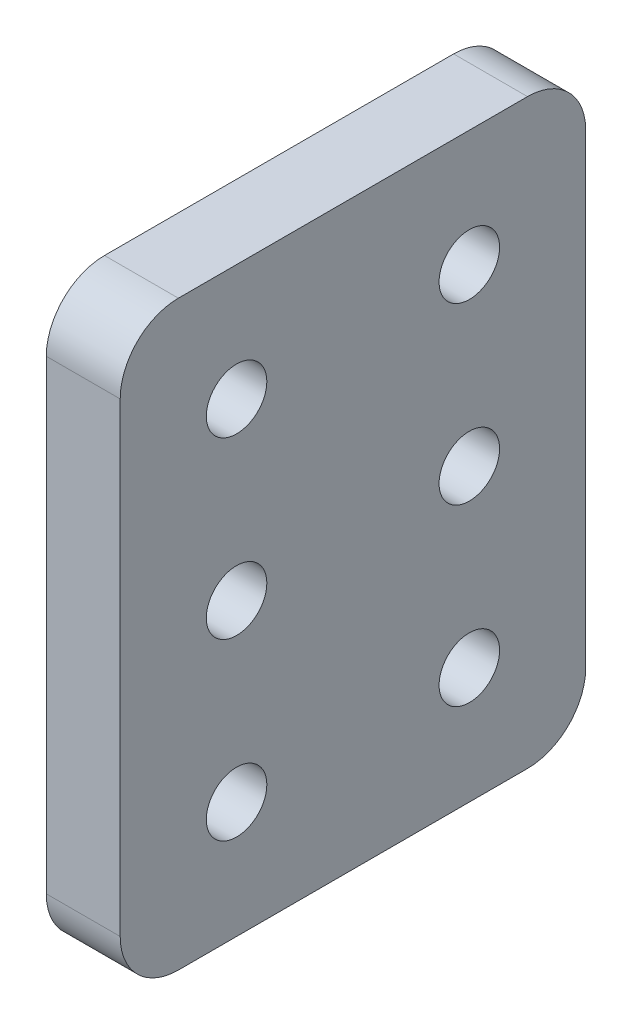
ISO-10303-21;
HEADER;
FILE_DESCRIPTION(('STEP AP214'),'2;1');
FILE_NAME('part.step','',(''),(''),'','','');
FILE_SCHEMA(('AUTOMOTIVE_DESIGN { 1 0 10303 214 1 1 1 1 }'));
ENDSEC;
DATA;
#1=APPLICATION_CONTEXT('core data for automotive mechanical design processes');
#2=APPLICATION_PROTOCOL_DEFINITION('international standard','automotive_design',2000,#1);
#3=PRODUCT_CONTEXT('',#1,'mechanical');
#4=PRODUCT('Part','Part','',(#3));
#5=PRODUCT_RELATED_PRODUCT_CATEGORY('part','',(#4));
#6=PRODUCT_DEFINITION_FORMATION('','',#4);
#7=PRODUCT_DEFINITION_CONTEXT('part definition',#1,'design');
#8=PRODUCT_DEFINITION('design','',#6,#7);
#9=PRODUCT_DEFINITION_SHAPE('','',#8);
#10=(LENGTH_UNIT() NAMED_UNIT(*) SI_UNIT(.MILLI.,.METRE.));
#11=(NAMED_UNIT(*) PLANE_ANGLE_UNIT() SI_UNIT($,.RADIAN.));
#12=(NAMED_UNIT(*) SI_UNIT($,.STERADIAN.) SOLID_ANGLE_UNIT());
#13=UNCERTAINTY_MEASURE_WITH_UNIT(LENGTH_MEASURE(1.E-05),#10,'distance_accuracy_value','');
#14=(GEOMETRIC_REPRESENTATION_CONTEXT(3) GLOBAL_UNCERTAINTY_ASSIGNED_CONTEXT((#13)) GLOBAL_UNIT_ASSIGNED_CONTEXT((#10,
#11,#12)) REPRESENTATION_CONTEXT('',''));
#15=CARTESIAN_POINT('',(0.,0.,0.));
#16=DIRECTION('',(0.,0.,1.));
#17=DIRECTION('',(1.,0.,0.));
#18=AXIS2_PLACEMENT_3D('',#15,#16,#17);
#19=CARTESIAN_POINT('',(43.5,73.,-125.6));
#20=DIRECTION('',(-1.,0.,0.));
#21=DIRECTION('',(0.,0.,1.));
#22=AXIS2_PLACEMENT_3D('',#19,#20,#21);
#23=PLANE('',#22);
#24=CARTESIAN_POINT('',(43.5,58.,-135.6));
#25=DIRECTION('',(-1.,0.,0.));
#26=DIRECTION('',(0.,0.,1.));
#27=AXIS2_PLACEMENT_3D('',#24,#25,#26);
#28=CIRCLE('',#27,2.6);
#29=CARTESIAN_POINT('',(43.5,58.,-138.2));
#30=VERTEX_POINT('',#29);
#31=EDGE_CURVE('E141',#30,#30,#28,.T.);
#32=ORIENTED_EDGE('',*,*,#31,.T.);
#33=EDGE_LOOP('',(#32));
#34=FACE_BOUND('',#33,.T.);
#35=CARTESIAN_POINT('',(43.5,73.,-135.6));
#36=DIRECTION('',(-1.,0.,0.));
#37=DIRECTION('',(0.,0.,1.));
#38=AXIS2_PLACEMENT_3D('',#35,#36,#37);
#39=CIRCLE('',#38,2.6);
#40=CARTESIAN_POINT('',(43.5,73.,-138.2));
#41=VERTEX_POINT('',#40);
#42=EDGE_CURVE('E167',#41,#41,#39,.T.);
#43=ORIENTED_EDGE('',*,*,#42,.T.);
#44=EDGE_LOOP('',(#43));
#45=FACE_BOUND('',#44,.T.);
#46=CARTESIAN_POINT('',(43.5,88.,-135.6));
#47=DIRECTION('',(-1.,0.,0.));
#48=DIRECTION('',(0.,0.,1.));
#49=AXIS2_PLACEMENT_3D('',#46,#47,#48);
#50=CIRCLE('',#49,2.6);
#51=CARTESIAN_POINT('',(43.5,88.,-138.2));
#52=VERTEX_POINT('',#51);
#53=EDGE_CURVE('E168',#52,#52,#50,.T.);
#54=ORIENTED_EDGE('',*,*,#53,.T.);
#55=EDGE_LOOP('',(#54));
#56=FACE_BOUND('',#55,.T.);
#57=CARTESIAN_POINT('',(43.5,58.,-115.6));
#58=DIRECTION('',(-1.,0.,0.));
#59=DIRECTION('',(0.,0.,1.));
#60=AXIS2_PLACEMENT_3D('',#57,#58,#59);
#61=CIRCLE('',#60,2.6);
#62=CARTESIAN_POINT('',(43.5,58.,-118.2));
#63=VERTEX_POINT('',#62);
#64=EDGE_CURVE('E238',#63,#63,#61,.T.);
#65=ORIENTED_EDGE('',*,*,#64,.T.);
#66=EDGE_LOOP('',(#65));
#67=FACE_BOUND('',#66,.T.);
#68=CARTESIAN_POINT('',(43.5,73.,-115.6));
#69=DIRECTION('',(-1.,0.,0.));
#70=DIRECTION('',(0.,0.,1.));
#71=AXIS2_PLACEMENT_3D('',#68,#69,#70);
#72=CIRCLE('',#71,2.6);
#73=CARTESIAN_POINT('',(43.5,73.,-118.2));
#74=VERTEX_POINT('',#73);
#75=EDGE_CURVE('E244',#74,#74,#72,.T.);
#76=ORIENTED_EDGE('',*,*,#75,.T.);
#77=EDGE_LOOP('',(#76));
#78=FACE_BOUND('',#77,.T.);
#79=CARTESIAN_POINT('',(43.5,88.,-115.6));
#80=DIRECTION('',(-1.,0.,0.));
#81=DIRECTION('',(0.,0.,1.));
#82=AXIS2_PLACEMENT_3D('',#79,#80,#81);
#83=CIRCLE('',#82,2.6);
#84=CARTESIAN_POINT('',(43.5,88.,-118.2));
#85=VERTEX_POINT('',#84);
#86=EDGE_CURVE('E181',#85,#85,#83,.T.);
#87=ORIENTED_EDGE('',*,*,#86,.T.);
#88=EDGE_LOOP('',(#87));
#89=FACE_BOUND('',#88,.T.);
#90=CARTESIAN_POINT('',(43.5,93.,-140.6));
#91=DIRECTION('',(-1.,0.,0.));
#92=DIRECTION('',(0.,0.707106781186548,-0.707106781186548));
#93=AXIS2_PLACEMENT_3D('',#90,#91,#92);
#94=CIRCLE('',#93,5.);
#95=CARTESIAN_POINT('',(43.5,98.,-140.6));
#96=VERTEX_POINT('',#95);
#97=CARTESIAN_POINT('',(43.5,93.,-145.6));
#98=VERTEX_POINT('',#97);
#99=EDGE_CURVE('E163',#96,#98,#94,.T.);
#100=ORIENTED_EDGE('',*,*,#99,.F.);
#101=DIRECTION('',(0.,0.,1.));
#102=VECTOR('',#101,1.);
#103=CARTESIAN_POINT('',(43.5,98.,-145.6));
#104=LINE('',#103,#102);
#105=CARTESIAN_POINT('',(43.5,98.,-110.6));
#106=VERTEX_POINT('',#105);
#107=EDGE_CURVE('E199',#96,#106,#104,.T.);
#108=ORIENTED_EDGE('',*,*,#107,.T.);
#109=CARTESIAN_POINT('',(43.5,93.,-110.6));
#110=DIRECTION('',(-1.,0.,0.));
#111=DIRECTION('',(0.,0.707106781186548,0.707106781186548));
#112=AXIS2_PLACEMENT_3D('',#109,#110,#111);
#113=CIRCLE('',#112,5.);
#114=CARTESIAN_POINT('',(43.5,93.,-105.6));
#115=VERTEX_POINT('',#114);
#116=EDGE_CURVE('E156',#115,#106,#113,.T.);
#117=ORIENTED_EDGE('',*,*,#116,.F.);
#118=DIRECTION('',(0.,-1.,0.));
#119=VECTOR('',#118,1.);
#120=CARTESIAN_POINT('',(43.5,98.,-105.6));
#121=LINE('',#120,#119);
#122=CARTESIAN_POINT('',(43.5,53.,-105.6));
#123=VERTEX_POINT('',#122);
#124=EDGE_CURVE('E194',#115,#123,#121,.T.);
#125=ORIENTED_EDGE('',*,*,#124,.T.);
#126=CARTESIAN_POINT('',(43.5,53.,-110.6));
#127=DIRECTION('',(-1.,0.,0.));
#128=DIRECTION('',(0.,-0.707106781186548,0.707106781186548));
#129=AXIS2_PLACEMENT_3D('',#126,#127,#128);
#130=CIRCLE('',#129,5.);
#131=CARTESIAN_POINT('',(43.5,48.,-110.6));
#132=VERTEX_POINT('',#131);
#133=EDGE_CURVE('E170',#132,#123,#130,.T.);
#134=ORIENTED_EDGE('',*,*,#133,.F.);
#135=DIRECTION('',(0.,0.,-1.));
#136=VECTOR('',#135,1.);
#137=CARTESIAN_POINT('',(43.5,48.,-105.6));
#138=LINE('',#137,#136);
#139=CARTESIAN_POINT('',(43.5,48.,-140.6));
#140=VERTEX_POINT('',#139);
#141=EDGE_CURVE('E177',#132,#140,#138,.T.);
#142=ORIENTED_EDGE('',*,*,#141,.T.);
#143=CARTESIAN_POINT('',(43.5,53.,-140.6));
#144=DIRECTION('',(-1.,0.,0.));
#145=DIRECTION('',(0.,-0.707106781186548,-0.707106781186548));
#146=AXIS2_PLACEMENT_3D('',#143,#144,#145);
#147=CIRCLE('',#146,5.);
#148=CARTESIAN_POINT('',(43.5,53.,-145.6));
#149=VERTEX_POINT('',#148);
#150=EDGE_CURVE('E178',#149,#140,#147,.T.);
#151=ORIENTED_EDGE('',*,*,#150,.F.);
#152=DIRECTION('',(0.,1.,0.));
#153=VECTOR('',#152,1.);
#154=CARTESIAN_POINT('',(43.5,48.,-145.6));
#155=LINE('',#154,#153);
#156=EDGE_CURVE('E11',#149,#98,#155,.T.);
#157=ORIENTED_EDGE('',*,*,#156,.T.);
#158=EDGE_LOOP('',(#100,#108,#117,#125,#134,#142,#151,#157));
#159=FACE_BOUND('',#158,.T.);
#160=ADVANCED_FACE('F17',(#34,#45,#56,#67,#78,#89,#159),#23,.F.);
#161=CARTESIAN_POINT('',(43.5,98.,-145.6));
#162=DIRECTION('',(0.,0.,-1.));
#163=DIRECTION('',(0.,-1.,0.));
#164=AXIS2_PLACEMENT_3D('',#161,#162,#163);
#165=PLANE('',#164);
#166=DIRECTION('',(-1.,0.,0.));
#167=VECTOR('',#166,1.);
#168=CARTESIAN_POINT('',(43.5,93.,-145.6));
#169=LINE('',#168,#167);
#170=CARTESIAN_POINT('',(37.15,93.,-145.6));
#171=VERTEX_POINT('',#170);
#172=EDGE_CURVE('E223',#98,#171,#169,.T.);
#173=ORIENTED_EDGE('',*,*,#172,.F.);
#174=ORIENTED_EDGE('',*,*,#156,.F.);
#175=DIRECTION('',(1.,0.,0.));
#176=VECTOR('',#175,1.);
#177=CARTESIAN_POINT('',(43.5,53.,-145.6));
#178=LINE('',#177,#176);
#179=CARTESIAN_POINT('',(37.15,53.,-145.6));
#180=VERTEX_POINT('',#179);
#181=EDGE_CURVE('E182',#180,#149,#178,.T.);
#182=ORIENTED_EDGE('',*,*,#181,.F.);
#183=DIRECTION('',(0.,-1.,0.));
#184=VECTOR('',#183,1.);
#185=CARTESIAN_POINT('',(37.15,48.,-145.6));
#186=LINE('',#185,#184);
#187=EDGE_CURVE('E202',#171,#180,#186,.T.);
#188=ORIENTED_EDGE('',*,*,#187,.F.);
#189=EDGE_LOOP('',(#173,#174,#182,#188));
#190=FACE_BOUND('',#189,.T.);
#191=ADVANCED_FACE('F301',(#190),#165,.T.);
#192=CARTESIAN_POINT('',(107.,58.,-135.6));
#193=DIRECTION('',(-1.,0.,0.));
#194=DIRECTION('',(0.,0.,1.));
#195=AXIS2_PLACEMENT_3D('',#192,#193,#194);
#196=CYLINDRICAL_SURFACE('',#195,2.6);
#197=ORIENTED_EDGE('',*,*,#31,.F.);
#198=DIRECTION('',(-1.,0.,0.));
#199=VECTOR('',#198,1.);
#200=CARTESIAN_POINT('',(107.,58.,-138.2));
#201=LINE('',#200,#199);
#202=CARTESIAN_POINT('',(37.15,58.,-138.2));
#203=VERTEX_POINT('',#202);
#204=EDGE_CURVE('E27',#30,#203,#201,.T.);
#205=ORIENTED_EDGE('',*,*,#204,.T.);
#206=CARTESIAN_POINT('',(37.15,58.,-135.6));
#207=DIRECTION('',(1.,0.,0.));
#208=DIRECTION('',(0.,0.,1.));
#209=AXIS2_PLACEMENT_3D('',#206,#207,#208);
#210=CIRCLE('',#209,2.6);
#211=EDGE_CURVE('E140',#203,#203,#210,.T.);
#212=ORIENTED_EDGE('',*,*,#211,.F.);
#213=ORIENTED_EDGE('',*,*,#204,.F.);
#214=EDGE_LOOP('',(#197,#205,#212,#213));
#215=FACE_BOUND('',#214,.T.);
#216=ADVANCED_FACE('F139',(#215),#196,.F.);
#217=CARTESIAN_POINT('',(107.,73.,-135.6));
#218=DIRECTION('',(-1.,0.,0.));
#219=DIRECTION('',(0.,0.,1.));
#220=AXIS2_PLACEMENT_3D('',#217,#218,#219);
#221=CYLINDRICAL_SURFACE('',#220,2.6);
#222=ORIENTED_EDGE('',*,*,#42,.F.);
#223=DIRECTION('',(-1.,0.,0.));
#224=VECTOR('',#223,1.);
#225=CARTESIAN_POINT('',(107.,73.,-138.2));
#226=LINE('',#225,#224);
#227=CARTESIAN_POINT('',(37.15,73.,-138.2));
#228=VERTEX_POINT('',#227);
#229=EDGE_CURVE('E20',#41,#228,#226,.T.);
#230=ORIENTED_EDGE('',*,*,#229,.T.);
#231=CARTESIAN_POINT('',(37.15,73.,-135.6));
#232=DIRECTION('',(1.,0.,0.));
#233=DIRECTION('',(0.,0.,1.));
#234=AXIS2_PLACEMENT_3D('',#231,#232,#233);
#235=CIRCLE('',#234,2.6);
#236=EDGE_CURVE('E149',#228,#228,#235,.T.);
#237=ORIENTED_EDGE('',*,*,#236,.F.);
#238=ORIENTED_EDGE('',*,*,#229,.F.);
#239=EDGE_LOOP('',(#222,#230,#237,#238));
#240=FACE_BOUND('',#239,.T.);
#241=ADVANCED_FACE('F366',(#240),#221,.F.);
#242=CARTESIAN_POINT('',(107.,88.,-135.6));
#243=DIRECTION('',(-1.,0.,0.));
#244=DIRECTION('',(0.,0.,1.));
#245=AXIS2_PLACEMENT_3D('',#242,#243,#244);
#246=CYLINDRICAL_SURFACE('',#245,2.6);
#247=ORIENTED_EDGE('',*,*,#53,.F.);
#248=DIRECTION('',(-1.,0.,0.));
#249=VECTOR('',#248,1.);
#250=CARTESIAN_POINT('',(107.,88.,-138.2));
#251=LINE('',#250,#249);
#252=CARTESIAN_POINT('',(37.15,88.,-138.2));
#253=VERTEX_POINT('',#252);
#254=EDGE_CURVE('E165',#52,#253,#251,.T.);
#255=ORIENTED_EDGE('',*,*,#254,.T.);
#256=CARTESIAN_POINT('',(37.15,88.,-135.6));
#257=DIRECTION('',(1.,0.,0.));
#258=DIRECTION('',(0.,0.,1.));
#259=AXIS2_PLACEMENT_3D('',#256,#257,#258);
#260=CIRCLE('',#259,2.6);
#261=EDGE_CURVE('E160',#253,#253,#260,.T.);
#262=ORIENTED_EDGE('',*,*,#261,.F.);
#263=ORIENTED_EDGE('',*,*,#254,.F.);
#264=EDGE_LOOP('',(#247,#255,#262,#263));
#265=FACE_BOUND('',#264,.T.);
#266=ADVANCED_FACE('F371',(#265),#246,.F.);
#267=CARTESIAN_POINT('',(107.,58.,-115.6));
#268=DIRECTION('',(-1.,0.,0.));
#269=DIRECTION('',(0.,0.,1.));
#270=AXIS2_PLACEMENT_3D('',#267,#268,#269);
#271=CYLINDRICAL_SURFACE('',#270,2.6);
#272=ORIENTED_EDGE('',*,*,#64,.F.);
#273=DIRECTION('',(-1.,0.,0.));
#274=VECTOR('',#273,1.);
#275=CARTESIAN_POINT('',(107.,58.,-118.2));
#276=LINE('',#275,#274);
#277=CARTESIAN_POINT('',(37.15,58.,-118.2));
#278=VERTEX_POINT('',#277);
#279=EDGE_CURVE('E242',#63,#278,#276,.T.);
#280=ORIENTED_EDGE('',*,*,#279,.T.);
#281=CARTESIAN_POINT('',(37.15,58.,-115.6));
#282=DIRECTION('',(1.,0.,0.));
#283=DIRECTION('',(0.,0.,1.));
#284=AXIS2_PLACEMENT_3D('',#281,#282,#283);
#285=CIRCLE('',#284,2.6);
#286=EDGE_CURVE('E198',#278,#278,#285,.T.);
#287=ORIENTED_EDGE('',*,*,#286,.F.);
#288=ORIENTED_EDGE('',*,*,#279,.F.);
#289=EDGE_LOOP('',(#272,#280,#287,#288));
#290=FACE_BOUND('',#289,.T.);
#291=ADVANCED_FACE('F409',(#290),#271,.F.);
#292=CARTESIAN_POINT('',(107.,73.,-115.6));
#293=DIRECTION('',(-1.,0.,0.));
#294=DIRECTION('',(0.,0.,1.));
#295=AXIS2_PLACEMENT_3D('',#292,#293,#294);
#296=CYLINDRICAL_SURFACE('',#295,2.6);
#297=ORIENTED_EDGE('',*,*,#75,.F.);
#298=DIRECTION('',(-1.,0.,0.));
#299=VECTOR('',#298,1.);
#300=CARTESIAN_POINT('',(107.,73.,-118.2));
#301=LINE('',#300,#299);
#302=CARTESIAN_POINT('',(37.15,73.,-118.2));
#303=VERTEX_POINT('',#302);
#304=EDGE_CURVE('E98',#74,#303,#301,.T.);
#305=ORIENTED_EDGE('',*,*,#304,.T.);
#306=CARTESIAN_POINT('',(37.15,73.,-115.6));
#307=DIRECTION('',(1.,0.,0.));
#308=DIRECTION('',(0.,0.,1.));
#309=AXIS2_PLACEMENT_3D('',#306,#307,#308);
#310=CIRCLE('',#309,2.6);
#311=EDGE_CURVE('E227',#303,#303,#310,.T.);
#312=ORIENTED_EDGE('',*,*,#311,.F.);
#313=ORIENTED_EDGE('',*,*,#304,.F.);
#314=EDGE_LOOP('',(#297,#305,#312,#313));
#315=FACE_BOUND('',#314,.T.);
#316=ADVANCED_FACE('F404',(#315),#296,.F.);
#317=CARTESIAN_POINT('',(107.,88.,-115.6));
#318=DIRECTION('',(-1.,0.,0.));
#319=DIRECTION('',(0.,0.,1.));
#320=AXIS2_PLACEMENT_3D('',#317,#318,#319);
#321=CYLINDRICAL_SURFACE('',#320,2.6);
#322=ORIENTED_EDGE('',*,*,#86,.F.);
#323=DIRECTION('',(-1.,0.,0.));
#324=VECTOR('',#323,1.);
#325=CARTESIAN_POINT('',(107.,88.,-118.2));
#326=LINE('',#325,#324);
#327=CARTESIAN_POINT('',(37.15,88.,-118.2));
#328=VERTEX_POINT('',#327);
#329=EDGE_CURVE('E113',#85,#328,#326,.T.);
#330=ORIENTED_EDGE('',*,*,#329,.T.);
#331=CARTESIAN_POINT('',(37.15,88.,-115.6));
#332=DIRECTION('',(1.,0.,0.));
#333=DIRECTION('',(0.,0.,1.));
#334=AXIS2_PLACEMENT_3D('',#331,#332,#333);
#335=CIRCLE('',#334,2.6);
#336=EDGE_CURVE('E189',#328,#328,#335,.T.);
#337=ORIENTED_EDGE('',*,*,#336,.F.);
#338=ORIENTED_EDGE('',*,*,#329,.F.);
#339=EDGE_LOOP('',(#322,#330,#337,#338));
#340=FACE_BOUND('',#339,.T.);
#341=ADVANCED_FACE('F298',(#340),#321,.F.);
#342=CARTESIAN_POINT('',(43.5,53.,-140.6));
#343=DIRECTION('',(-1.,0.,0.));
#344=DIRECTION('',(0.,-0.707106781186548,-0.707106781186548));
#345=AXIS2_PLACEMENT_3D('',#342,#343,#344);
#346=CYLINDRICAL_SURFACE('',#345,5.);
#347=CARTESIAN_POINT('',(37.15,53.,-140.6));
#348=DIRECTION('',(1.,0.,0.));
#349=DIRECTION('',(0.,-0.707106781186548,-0.707106781186548));
#350=AXIS2_PLACEMENT_3D('',#347,#348,#349);
#351=CIRCLE('',#350,5.);
#352=CARTESIAN_POINT('',(37.15,48.,-140.6));
#353=VERTEX_POINT('',#352);
#354=EDGE_CURVE('E211',#353,#180,#351,.T.);
#355=ORIENTED_EDGE('',*,*,#354,.T.);
#356=ORIENTED_EDGE('',*,*,#181,.T.);
#357=ORIENTED_EDGE('',*,*,#150,.T.);
#358=DIRECTION('',(-1.,0.,0.));
#359=VECTOR('',#358,1.);
#360=CARTESIAN_POINT('',(43.5,48.,-140.6));
#361=LINE('',#360,#359);
#362=EDGE_CURVE('E173',#140,#353,#361,.T.);
#363=ORIENTED_EDGE('',*,*,#362,.T.);
#364=EDGE_LOOP('',(#355,#356,#357,#363));
#365=FACE_BOUND('',#364,.T.);
#366=ADVANCED_FACE('F344',(#365),#346,.T.);
#367=CARTESIAN_POINT('',(43.5,48.,-145.6));
#368=DIRECTION('',(0.,-1.,0.));
#369=DIRECTION('',(0.,0.,-1.));
#370=AXIS2_PLACEMENT_3D('',#367,#368,#369);
#371=PLANE('',#370);
#372=DIRECTION('',(1.,0.,0.));
#373=VECTOR('',#372,1.);
#374=CARTESIAN_POINT('',(43.5,48.,-110.6));
#375=LINE('',#374,#373);
#376=CARTESIAN_POINT('',(37.15,48.,-110.6));
#377=VERTEX_POINT('',#376);
#378=EDGE_CURVE('E174',#377,#132,#375,.T.);
#379=ORIENTED_EDGE('',*,*,#378,.F.);
#380=DIRECTION('',(0.,0.,1.));
#381=VECTOR('',#380,1.);
#382=CARTESIAN_POINT('',(37.15,48.,-105.6));
#383=LINE('',#382,#381);
#384=EDGE_CURVE('E232',#353,#377,#383,.T.);
#385=ORIENTED_EDGE('',*,*,#384,.F.);
#386=ORIENTED_EDGE('',*,*,#362,.F.);
#387=ORIENTED_EDGE('',*,*,#141,.F.);
#388=EDGE_LOOP('',(#379,#385,#386,#387));
#389=FACE_BOUND('',#388,.T.);
#390=ADVANCED_FACE('F337',(#389),#371,.T.);
#391=CARTESIAN_POINT('',(43.5,53.,-110.6));
#392=DIRECTION('',(-1.,0.,0.));
#393=DIRECTION('',(0.,-0.707106781186548,0.707106781186548));
#394=AXIS2_PLACEMENT_3D('',#391,#392,#393);
#395=CYLINDRICAL_SURFACE('',#394,5.);
#396=CARTESIAN_POINT('',(37.15,53.,-110.6));
#397=DIRECTION('',(1.,0.,0.));
#398=DIRECTION('',(0.,-0.707106781186548,0.707106781186548));
#399=AXIS2_PLACEMENT_3D('',#396,#397,#398);
#400=CIRCLE('',#399,5.);
#401=CARTESIAN_POINT('',(37.15,53.,-105.6));
#402=VERTEX_POINT('',#401);
#403=EDGE_CURVE('E228',#402,#377,#400,.T.);
#404=ORIENTED_EDGE('',*,*,#403,.T.);
#405=ORIENTED_EDGE('',*,*,#378,.T.);
#406=ORIENTED_EDGE('',*,*,#133,.T.);
#407=DIRECTION('',(-1.,0.,0.));
#408=VECTOR('',#407,1.);
#409=CARTESIAN_POINT('',(43.5,53.,-105.6));
#410=LINE('',#409,#408);
#411=EDGE_CURVE('E249',#123,#402,#410,.T.);
#412=ORIENTED_EDGE('',*,*,#411,.T.);
#413=EDGE_LOOP('',(#404,#405,#406,#412));
#414=FACE_BOUND('',#413,.T.);
#415=ADVANCED_FACE('F328',(#414),#395,.T.);
#416=CARTESIAN_POINT('',(43.5,48.,-105.6));
#417=DIRECTION('',(0.,0.,1.));
#418=DIRECTION('',(1.,0.,0.));
#419=AXIS2_PLACEMENT_3D('',#416,#417,#418);
#420=PLANE('',#419);
#421=DIRECTION('',(1.,0.,0.));
#422=VECTOR('',#421,1.);
#423=CARTESIAN_POINT('',(43.5,93.,-105.6));
#424=LINE('',#423,#422);
#425=CARTESIAN_POINT('',(37.15,93.,-105.6));
#426=VERTEX_POINT('',#425);
#427=EDGE_CURVE('E148',#426,#115,#424,.T.);
#428=ORIENTED_EDGE('',*,*,#427,.F.);
#429=DIRECTION('',(0.,1.,0.));
#430=VECTOR('',#429,1.);
#431=CARTESIAN_POINT('',(37.15,98.,-105.6));
#432=LINE('',#431,#430);
#433=EDGE_CURVE('E190',#402,#426,#432,.T.);
#434=ORIENTED_EDGE('',*,*,#433,.F.);
#435=ORIENTED_EDGE('',*,*,#411,.F.);
#436=ORIENTED_EDGE('',*,*,#124,.F.);
#437=EDGE_LOOP('',(#428,#434,#435,#436));
#438=FACE_BOUND('',#437,.T.);
#439=ADVANCED_FACE('F332',(#438),#420,.T.);
#440=CARTESIAN_POINT('',(43.5,93.,-110.6));
#441=DIRECTION('',(-1.,0.,0.));
#442=DIRECTION('',(0.,0.707106781186548,0.707106781186548));
#443=AXIS2_PLACEMENT_3D('',#440,#441,#442);
#444=CYLINDRICAL_SURFACE('',#443,5.);
#445=CARTESIAN_POINT('',(37.15,93.,-110.6));
#446=DIRECTION('',(1.,0.,0.));
#447=DIRECTION('',(0.,0.707106781186548,0.707106781186548));
#448=AXIS2_PLACEMENT_3D('',#445,#446,#447);
#449=CIRCLE('',#448,5.);
#450=CARTESIAN_POINT('',(37.15,98.,-110.6));
#451=VERTEX_POINT('',#450);
#452=EDGE_CURVE('E185',#451,#426,#449,.T.);
#453=ORIENTED_EDGE('',*,*,#452,.T.);
#454=ORIENTED_EDGE('',*,*,#427,.T.);
#455=ORIENTED_EDGE('',*,*,#116,.T.);
#456=DIRECTION('',(-1.,0.,0.));
#457=VECTOR('',#456,1.);
#458=CARTESIAN_POINT('',(43.5,98.,-110.6));
#459=LINE('',#458,#457);
#460=EDGE_CURVE('E203',#106,#451,#459,.T.);
#461=ORIENTED_EDGE('',*,*,#460,.T.);
#462=EDGE_LOOP('',(#453,#454,#455,#461));
#463=FACE_BOUND('',#462,.T.);
#464=ADVANCED_FACE('F338',(#463),#444,.T.);
#465=CARTESIAN_POINT('',(37.15,73.,-125.6));
#466=DIRECTION('',(-1.,0.,0.));
#467=DIRECTION('',(0.,0.,1.));
#468=AXIS2_PLACEMENT_3D('',#465,#466,#467);
#469=PLANE('',#468);
#470=ORIENTED_EDGE('',*,*,#211,.T.);
#471=EDGE_LOOP('',(#470));
#472=FACE_BOUND('',#471,.T.);
#473=ORIENTED_EDGE('',*,*,#236,.T.);
#474=EDGE_LOOP('',(#473));
#475=FACE_BOUND('',#474,.T.);
#476=ORIENTED_EDGE('',*,*,#261,.T.);
#477=EDGE_LOOP('',(#476));
#478=FACE_BOUND('',#477,.T.);
#479=ORIENTED_EDGE('',*,*,#286,.T.);
#480=EDGE_LOOP('',(#479));
#481=FACE_BOUND('',#480,.T.);
#482=ORIENTED_EDGE('',*,*,#311,.T.);
#483=EDGE_LOOP('',(#482));
#484=FACE_BOUND('',#483,.T.);
#485=ORIENTED_EDGE('',*,*,#336,.T.);
#486=EDGE_LOOP('',(#485));
#487=FACE_BOUND('',#486,.T.);
#488=CARTESIAN_POINT('',(37.15,93.,-140.6));
#489=DIRECTION('',(1.,0.,0.));
#490=DIRECTION('',(0.,0.707106781186548,-0.707106781186548));
#491=AXIS2_PLACEMENT_3D('',#488,#489,#490);
#492=CIRCLE('',#491,5.);
#493=CARTESIAN_POINT('',(37.15,98.,-140.6));
#494=VERTEX_POINT('',#493);
#495=EDGE_CURVE('E270',#171,#494,#492,.T.);
#496=ORIENTED_EDGE('',*,*,#495,.F.);
#497=ORIENTED_EDGE('',*,*,#187,.T.);
#498=ORIENTED_EDGE('',*,*,#354,.F.);
#499=ORIENTED_EDGE('',*,*,#384,.T.);
#500=ORIENTED_EDGE('',*,*,#403,.F.);
#501=ORIENTED_EDGE('',*,*,#433,.T.);
#502=ORIENTED_EDGE('',*,*,#452,.F.);
#503=DIRECTION('',(0.,0.,-1.));
#504=VECTOR('',#503,1.);
#505=CARTESIAN_POINT('',(37.15,98.,-145.6));
#506=LINE('',#505,#504);
#507=EDGE_CURVE('E215',#451,#494,#506,.T.);
#508=ORIENTED_EDGE('',*,*,#507,.T.);
#509=EDGE_LOOP('',(#496,#497,#498,#499,#500,#501,#502,#508));
#510=FACE_BOUND('',#509,.T.);
#511=ADVANCED_FACE('F145',(#472,#475,#478,#481,#484,#487,#510),#469,.T.);
#512=CARTESIAN_POINT('',(43.5,98.,-105.6));
#513=DIRECTION('',(0.,1.,0.));
#514=DIRECTION('',(1.,0.,0.));
#515=AXIS2_PLACEMENT_3D('',#512,#513,#514);
#516=PLANE('',#515);
#517=DIRECTION('',(1.,0.,0.));
#518=VECTOR('',#517,1.);
#519=CARTESIAN_POINT('',(43.5,98.,-140.6));
#520=LINE('',#519,#518);
#521=EDGE_CURVE('E274',#494,#96,#520,.T.);
#522=ORIENTED_EDGE('',*,*,#521,.F.);
#523=ORIENTED_EDGE('',*,*,#507,.F.);
#524=ORIENTED_EDGE('',*,*,#460,.F.);
#525=ORIENTED_EDGE('',*,*,#107,.F.);
#526=EDGE_LOOP('',(#522,#523,#524,#525));
#527=FACE_BOUND('',#526,.T.);
#528=ADVANCED_FACE('F312',(#527),#516,.T.);
#529=CARTESIAN_POINT('',(43.5,93.,-140.6));
#530=DIRECTION('',(-1.,0.,0.));
#531=DIRECTION('',(0.,0.707106781186548,-0.707106781186548));
#532=AXIS2_PLACEMENT_3D('',#529,#530,#531);
#533=CYLINDRICAL_SURFACE('',#532,5.);
#534=ORIENTED_EDGE('',*,*,#495,.T.);
#535=ORIENTED_EDGE('',*,*,#521,.T.);
#536=ORIENTED_EDGE('',*,*,#99,.T.);
#537=ORIENTED_EDGE('',*,*,#172,.T.);
#538=EDGE_LOOP('',(#534,#535,#536,#537));
#539=FACE_BOUND('',#538,.T.);
#540=ADVANCED_FACE('F309',(#539),#533,.T.);
#541=CLOSED_SHELL('',(#160,#191,#216,#241,#266,#291,#316,#341,#366,#390,#415,#439,#464,#511,
#528,#540));
#542=MANIFOLD_SOLID_BREP('B1',#541);
#543=ADVANCED_BREP_SHAPE_REPRESENTATION('',(#18,#542),#14);
#544=SHAPE_DEFINITION_REPRESENTATION(#9,#543);
ENDSEC;
END-ISO-10303-21;
